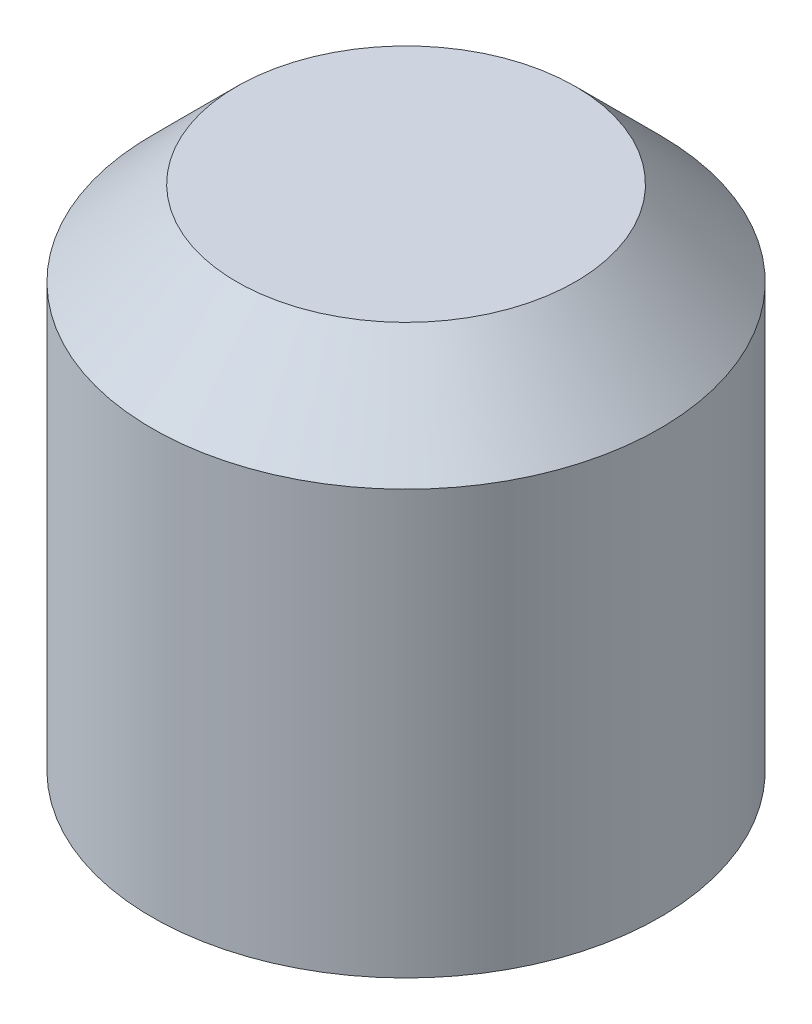
ISO-10303-21;
HEADER;
FILE_DESCRIPTION(('STEP AP214'),'2;1');
FILE_NAME('part.step','',(''),(''),'','','');
FILE_SCHEMA(('AUTOMOTIVE_DESIGN { 1 0 10303 214 1 1 1 1 }'));
ENDSEC;
DATA;
#1=APPLICATION_CONTEXT('core data for automotive mechanical design processes');
#2=APPLICATION_PROTOCOL_DEFINITION('international standard','automotive_design',2000,#1);
#3=PRODUCT_CONTEXT('',#1,'mechanical');
#4=PRODUCT('Part','Part','',(#3));
#5=PRODUCT_RELATED_PRODUCT_CATEGORY('part','',(#4));
#6=PRODUCT_DEFINITION_FORMATION('','',#4);
#7=PRODUCT_DEFINITION_CONTEXT('part definition',#1,'design');
#8=PRODUCT_DEFINITION('design','',#6,#7);
#9=PRODUCT_DEFINITION_SHAPE('','',#8);
#10=(LENGTH_UNIT() NAMED_UNIT(*) SI_UNIT(.MILLI.,.METRE.));
#11=(NAMED_UNIT(*) PLANE_ANGLE_UNIT() SI_UNIT($,.RADIAN.));
#12=(NAMED_UNIT(*) SI_UNIT($,.STERADIAN.) SOLID_ANGLE_UNIT());
#13=UNCERTAINTY_MEASURE_WITH_UNIT(LENGTH_MEASURE(1.E-05),#10,'distance_accuracy_value','');
#14=(GEOMETRIC_REPRESENTATION_CONTEXT(3) GLOBAL_UNCERTAINTY_ASSIGNED_CONTEXT((#13)) GLOBAL_UNIT_ASSIGNED_CONTEXT((#10,
#11,#12)) REPRESENTATION_CONTEXT('',''));
#15=CARTESIAN_POINT('',(0.,0.,0.));
#16=DIRECTION('',(0.,0.,1.));
#17=DIRECTION('',(1.,0.,0.));
#18=AXIS2_PLACEMENT_3D('',#15,#16,#17);
#19=CARTESIAN_POINT('',(-1.15470053837925,2.,0.));
#20=DIRECTION('',(-0.866025403784439,0.,-0.5));
#21=DIRECTION('',(-0.5,0.,0.866025403784439));
#22=AXIS2_PLACEMENT_3D('',#19,#20,#21);
#23=PLANE('',#22);
#24=DIRECTION('',(0.,1.,0.));
#25=VECTOR('',#24,1.);
#26=CARTESIAN_POINT('',(-0.577350269189626,2.,-1.));
#27=LINE('',#26,#25);
#28=CARTESIAN_POINT('',(-0.577350269189626,0.,-1.));
#29=VERTEX_POINT('',#28);
#30=CARTESIAN_POINT('',(-0.577350269189626,2.,-1.));
#31=VERTEX_POINT('',#30);
#32=EDGE_CURVE('E82',#29,#31,#27,.T.);
#33=ORIENTED_EDGE('',*,*,#32,.T.);
#34=DIRECTION('',(-0.5,0.,0.866025403784439));
#35=VECTOR('',#34,1.);
#36=CARTESIAN_POINT('',(-1.15470053837925,2.,0.));
#37=LINE('',#36,#35);
#38=CARTESIAN_POINT('',(-1.15470053837925,2.,0.));
#39=VERTEX_POINT('',#38);
#40=EDGE_CURVE('E71',#39,#31,#37,.F.);
#41=ORIENTED_EDGE('',*,*,#40,.F.);
#42=DIRECTION('',(0.,1.,0.));
#43=VECTOR('',#42,1.);
#44=CARTESIAN_POINT('',(-1.15470053837925,2.,0.));
#45=LINE('',#44,#43);
#46=CARTESIAN_POINT('',(-1.15470053837925,0.,0.));
#47=VERTEX_POINT('',#46);
#48=EDGE_CURVE('E90',#39,#47,#45,.F.);
#49=ORIENTED_EDGE('',*,*,#48,.T.);
#50=DIRECTION('',(-0.5,0.,0.866025403784439));
#51=VECTOR('',#50,1.);
#52=CARTESIAN_POINT('',(-1.15470053837925,0.,0.));
#53=LINE('',#52,#51);
#54=EDGE_CURVE('E66',#29,#47,#53,.T.);
#55=ORIENTED_EDGE('',*,*,#54,.F.);
#56=EDGE_LOOP('',(#33,#41,#49,#55));
#57=FACE_BOUND('',#56,.T.);
#58=ADVANCED_FACE('F17',(#57),#23,.F.);
#59=CARTESIAN_POINT('',(-0.577350269189626,2.,-1.));
#60=DIRECTION('',(0.,0.,-1.));
#61=DIRECTION('',(-1.,0.,0.));
#62=AXIS2_PLACEMENT_3D('',#59,#60,#61);
#63=PLANE('',#62);
#64=DIRECTION('',(0.,1.,0.));
#65=VECTOR('',#64,1.);
#66=CARTESIAN_POINT('',(0.577350269189626,2.,-1.));
#67=LINE('',#66,#65);
#68=CARTESIAN_POINT('',(0.577350269189626,0.,-1.));
#69=VERTEX_POINT('',#68);
#70=CARTESIAN_POINT('',(0.577350269189626,2.,-1.));
#71=VERTEX_POINT('',#70);
#72=EDGE_CURVE('E86',#69,#71,#67,.T.);
#73=ORIENTED_EDGE('',*,*,#72,.T.);
#74=DIRECTION('',(-1.,0.,0.));
#75=VECTOR('',#74,1.);
#76=CARTESIAN_POINT('',(-0.577350269189626,2.,-1.));
#77=LINE('',#76,#75);
#78=EDGE_CURVE('E75',#31,#71,#77,.F.);
#79=ORIENTED_EDGE('',*,*,#78,.F.);
#80=ORIENTED_EDGE('',*,*,#32,.F.);
#81=DIRECTION('',(-1.,0.,0.));
#82=VECTOR('',#81,1.);
#83=CARTESIAN_POINT('',(-0.577350269189626,0.,-1.));
#84=LINE('',#83,#82);
#85=EDGE_CURVE('E88',#69,#29,#84,.T.);
#86=ORIENTED_EDGE('',*,*,#85,.F.);
#87=EDGE_LOOP('',(#73,#79,#80,#86));
#88=FACE_BOUND('',#87,.T.);
#89=ADVANCED_FACE('F85',(#88),#63,.F.);
#90=CARTESIAN_POINT('',(-0.577350269189626,2.,1.));
#91=DIRECTION('',(-0.866025403784439,0.,0.5));
#92=DIRECTION('',(0.5,0.,0.866025403784439));
#93=AXIS2_PLACEMENT_3D('',#90,#91,#92);
#94=PLANE('',#93);
#95=ORIENTED_EDGE('',*,*,#48,.F.);
#96=DIRECTION('',(-0.5,0.,-0.866025403784439));
#97=VECTOR('',#96,1.);
#98=CARTESIAN_POINT('',(-0.577350269189626,2.,1.));
#99=LINE('',#98,#97);
#100=CARTESIAN_POINT('',(-0.577350269189626,2.,1.));
#101=VERTEX_POINT('',#100);
#102=EDGE_CURVE('E78',#101,#39,#99,.T.);
#103=ORIENTED_EDGE('',*,*,#102,.F.);
#104=DIRECTION('',(0.,1.,0.));
#105=VECTOR('',#104,1.);
#106=CARTESIAN_POINT('',(-0.577350269189626,2.,1.));
#107=LINE('',#106,#105);
#108=CARTESIAN_POINT('',(-0.577350269189626,0.,1.));
#109=VERTEX_POINT('',#108);
#110=EDGE_CURVE('E102',#101,#109,#107,.F.);
#111=ORIENTED_EDGE('',*,*,#110,.T.);
#112=DIRECTION('',(0.5,0.,0.866025403784439));
#113=VECTOR('',#112,1.);
#114=CARTESIAN_POINT('',(-0.577350269189626,0.,1.));
#115=LINE('',#114,#113);
#116=EDGE_CURVE('E97',#47,#109,#115,.T.);
#117=ORIENTED_EDGE('',*,*,#116,.F.);
#118=EDGE_LOOP('',(#95,#103,#111,#117));
#119=FACE_BOUND('',#118,.T.);
#120=ADVANCED_FACE('F100',(#119),#94,.F.);
#121=CARTESIAN_POINT('',(0.577350269189626,2.,-1.));
#122=DIRECTION('',(0.866025403784439,0.,-0.5));
#123=DIRECTION('',(-0.5,0.,-0.866025403784439));
#124=AXIS2_PLACEMENT_3D('',#121,#122,#123);
#125=PLANE('',#124);
#126=DIRECTION('',(0.,1.,0.));
#127=VECTOR('',#126,1.);
#128=CARTESIAN_POINT('',(1.15470053837925,2.,0.));
#129=LINE('',#128,#127);
#130=CARTESIAN_POINT('',(1.15470053837925,0.,0.));
#131=VERTEX_POINT('',#130);
#132=CARTESIAN_POINT('',(1.15470053837925,2.,0.));
#133=VERTEX_POINT('',#132);
#134=EDGE_CURVE('E116',#131,#133,#129,.T.);
#135=ORIENTED_EDGE('',*,*,#134,.T.);
#136=DIRECTION('',(0.5,0.,0.866025403784438));
#137=VECTOR('',#136,1.);
#138=CARTESIAN_POINT('',(0.577350269189626,2.,-1.));
#139=LINE('',#138,#137);
#140=EDGE_CURVE('E108',#71,#133,#139,.T.);
#141=ORIENTED_EDGE('',*,*,#140,.F.);
#142=ORIENTED_EDGE('',*,*,#72,.F.);
#143=DIRECTION('',(-0.5,0.,-0.866025403784439));
#144=VECTOR('',#143,1.);
#145=CARTESIAN_POINT('',(0.577350269189626,0.,-1.));
#146=LINE('',#145,#144);
#147=EDGE_CURVE('E34',#131,#69,#146,.T.);
#148=ORIENTED_EDGE('',*,*,#147,.F.);
#149=EDGE_LOOP('',(#135,#141,#142,#148));
#150=FACE_BOUND('',#149,.T.);
#151=ADVANCED_FACE('F206',(#150),#125,.F.);
#152=CARTESIAN_POINT('',(0.,2.,0.));
#153=DIRECTION('',(0.,-1.,0.));
#154=DIRECTION('',(0.,0.,-1.));
#155=AXIS2_PLACEMENT_3D('',#152,#153,#154);
#156=PLANE('',#155);
#157=ORIENTED_EDGE('',*,*,#40,.T.);
#158=ORIENTED_EDGE('',*,*,#78,.T.);
#159=ORIENTED_EDGE('',*,*,#140,.T.);
#160=DIRECTION('',(0.5,0.,-0.866025403784439));
#161=VECTOR('',#160,1.);
#162=CARTESIAN_POINT('',(1.15470053837925,2.,0.));
#163=LINE('',#162,#161);
#164=CARTESIAN_POINT('',(0.577350269189626,2.,1.));
#165=VERTEX_POINT('',#164);
#166=EDGE_CURVE('E118',#133,#165,#163,.F.);
#167=ORIENTED_EDGE('',*,*,#166,.T.);
#168=DIRECTION('',(1.,0.,0.));
#169=VECTOR('',#168,1.);
#170=CARTESIAN_POINT('',(0.577350269189626,2.,1.));
#171=LINE('',#170,#169);
#172=EDGE_CURVE('E111',#165,#101,#171,.F.);
#173=ORIENTED_EDGE('',*,*,#172,.T.);
#174=ORIENTED_EDGE('',*,*,#102,.T.);
#175=EDGE_LOOP('',(#157,#158,#159,#167,#173,#174));
#176=FACE_BOUND('',#175,.T.);
#177=ADVANCED_FACE('F72',(#176),#156,.T.);
#178=CARTESIAN_POINT('',(0.577350269189626,2.,1.));
#179=DIRECTION('',(0.,0.,1.));
#180=DIRECTION('',(1.,0.,0.));
#181=AXIS2_PLACEMENT_3D('',#178,#179,#180);
#182=PLANE('',#181);
#183=ORIENTED_EDGE('',*,*,#110,.F.);
#184=ORIENTED_EDGE('',*,*,#172,.F.);
#185=DIRECTION('',(0.,1.,0.));
#186=VECTOR('',#185,1.);
#187=CARTESIAN_POINT('',(0.577350269189625,2.,1.));
#188=LINE('',#187,#186);
#189=CARTESIAN_POINT('',(0.577350269189626,0.,1.));
#190=VERTEX_POINT('',#189);
#191=EDGE_CURVE('E120',#165,#190,#188,.F.);
#192=ORIENTED_EDGE('',*,*,#191,.T.);
#193=DIRECTION('',(1.,0.,0.));
#194=VECTOR('',#193,1.);
#195=CARTESIAN_POINT('',(0.577350269189626,0.,1.));
#196=LINE('',#195,#194);
#197=EDGE_CURVE('E114',#109,#190,#196,.T.);
#198=ORIENTED_EDGE('',*,*,#197,.F.);
#199=EDGE_LOOP('',(#183,#184,#192,#198));
#200=FACE_BOUND('',#199,.T.);
#201=ADVANCED_FACE('F138',(#200),#182,.F.);
#202=CARTESIAN_POINT('',(0.,3.,0.));
#203=DIRECTION('',(0.,1.,0.));
#204=DIRECTION('',(0.,0.,1.));
#205=AXIS2_PLACEMENT_3D('',#202,#203,#204);
#206=PLANE('',#205);
#207=CARTESIAN_POINT('',(0.,2.9999999999859,0.));
#208=DIRECTION('',(0.,-1.,0.));
#209=DIRECTION('',(0.,0.,-1.));
#210=AXIS2_PLACEMENT_3D('',#207,#208,#209);
#211=CIRCLE('',#210,0.99999999991951);
#212=CARTESIAN_POINT('',(0.,2.9999999999859,-0.99999999991951));
#213=VERTEX_POINT('',#212);
#214=EDGE_CURVE('E20',#213,#213,#211,.T.);
#215=ORIENTED_EDGE('',*,*,#214,.F.);
#216=EDGE_LOOP('',(#215));
#217=FACE_BOUND('',#216,.T.);
#218=ADVANCED_FACE('F135',(#217),#206,.T.);
#219=CARTESIAN_POINT('',(1.15470053837925,2.,0.));
#220=DIRECTION('',(0.866025403784439,0.,0.5));
#221=DIRECTION('',(0.5,0.,-0.866025403784439));
#222=AXIS2_PLACEMENT_3D('',#219,#220,#221);
#223=PLANE('',#222);
#224=ORIENTED_EDGE('',*,*,#191,.F.);
#225=ORIENTED_EDGE('',*,*,#166,.F.);
#226=ORIENTED_EDGE('',*,*,#134,.F.);
#227=DIRECTION('',(-0.5,0.,0.866025403784438));
#228=VECTOR('',#227,1.);
#229=CARTESIAN_POINT('',(1.15470053837925,0.,0.));
#230=LINE('',#229,#228);
#231=EDGE_CURVE('E125',#131,#190,#230,.T.);
#232=ORIENTED_EDGE('',*,*,#231,.T.);
#233=EDGE_LOOP('',(#224,#225,#226,#232));
#234=FACE_BOUND('',#233,.T.);
#235=ADVANCED_FACE('F137',(#234),#223,.F.);
#236=CARTESIAN_POINT('',(0.,2.49999999999773,0.));
#237=DIRECTION('',(0.,-1.,0.));
#238=DIRECTION('',(0.,0.,-1.));
#239=AXIS2_PLACEMENT_3D('',#236,#237,#238);
#240=CONICAL_SURFACE('',#239,1.49999999996453,0.785398163454292);
#241=CARTESIAN_POINT('',(0.,2.5,0.));
#242=DIRECTION('',(0.,-1.,0.));
#243=DIRECTION('',(0.,0.,-1.));
#244=AXIS2_PLACEMENT_3D('',#241,#242,#243);
#245=CIRCLE('',#244,1.5);
#246=CARTESIAN_POINT('',(0.,2.5,-1.5));
#247=VERTEX_POINT('',#246);
#248=EDGE_CURVE('E26',#247,#247,#245,.T.);
#249=ORIENTED_EDGE('',*,*,#248,.F.);
#250=EDGE_LOOP('',(#249));
#251=FACE_BOUND('',#250,.T.);
#252=ORIENTED_EDGE('',*,*,#214,.T.);
#253=EDGE_LOOP('',(#252));
#254=FACE_BOUND('',#253,.T.);
#255=ADVANCED_FACE('F133',(#251,#254),#240,.T.);
#256=CARTESIAN_POINT('',(0.,0.,0.));
#257=DIRECTION('',(0.,1.,0.));
#258=DIRECTION('',(0.,0.,1.));
#259=AXIS2_PLACEMENT_3D('',#256,#257,#258);
#260=PLANE('',#259);
#261=CARTESIAN_POINT('',(0.,0.,0.));
#262=DIRECTION('',(0.,-1.,0.));
#263=DIRECTION('',(0.,0.,-1.));
#264=AXIS2_PLACEMENT_3D('',#261,#262,#263);
#265=CIRCLE('',#264,1.5);
#266=CARTESIAN_POINT('',(0.,0.,-1.5));
#267=VERTEX_POINT('',#266);
#268=EDGE_CURVE('E10',#267,#267,#265,.F.);
#269=ORIENTED_EDGE('',*,*,#268,.F.);
#270=EDGE_LOOP('',(#269));
#271=FACE_BOUND('',#270,.T.);
#272=ORIENTED_EDGE('',*,*,#147,.T.);
#273=ORIENTED_EDGE('',*,*,#85,.T.);
#274=ORIENTED_EDGE('',*,*,#54,.T.);
#275=ORIENTED_EDGE('',*,*,#116,.T.);
#276=ORIENTED_EDGE('',*,*,#197,.T.);
#277=ORIENTED_EDGE('',*,*,#231,.F.);
#278=EDGE_LOOP('',(#272,#273,#274,#275,#276,#277));
#279=FACE_BOUND('',#278,.T.);
#280=ADVANCED_FACE('F95',(#271,#279),#260,.F.);
#281=CARTESIAN_POINT('',(0.,3.,0.));
#282=DIRECTION('',(0.,-1.,0.));
#283=DIRECTION('',(0.,0.,-1.));
#284=AXIS2_PLACEMENT_3D('',#281,#282,#283);
#285=CYLINDRICAL_SURFACE('',#284,1.5);
#286=ORIENTED_EDGE('',*,*,#268,.T.);
#287=EDGE_LOOP('',(#286));
#288=FACE_BOUND('',#287,.T.);
#289=ORIENTED_EDGE('',*,*,#248,.T.);
#290=EDGE_LOOP('',(#289));
#291=FACE_BOUND('',#290,.T.);
#292=ADVANCED_FACE('F148',(#288,#291),#285,.T.);
#293=CLOSED_SHELL('',(#58,#89,#120,#151,#177,#201,#218,#235,#255,#280,#292));
#294=MANIFOLD_SOLID_BREP('B1',#293);
#295=ADVANCED_BREP_SHAPE_REPRESENTATION('',(#18,#294),#14);
#296=SHAPE_DEFINITION_REPRESENTATION(#9,#295);
ENDSEC;
END-ISO-10303-21;
